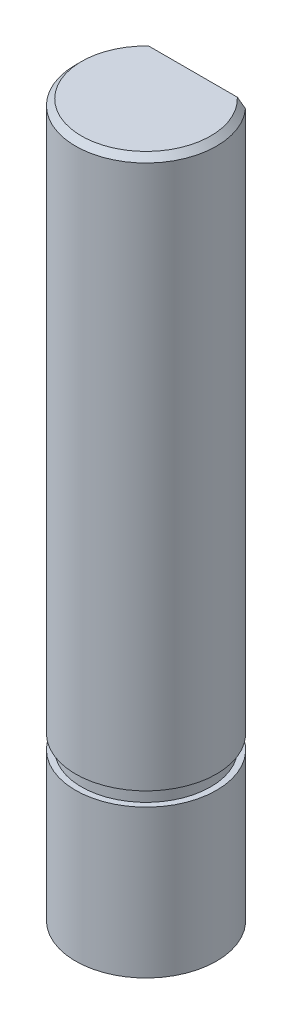
ISO-10303-21;
HEADER;
FILE_DESCRIPTION(('STEP AP214'),'2;1');
FILE_NAME('part.step','',(''),(''),'','','');
FILE_SCHEMA(('AUTOMOTIVE_DESIGN { 1 0 10303 214 1 1 1 1 }'));
ENDSEC;
DATA;
#1=APPLICATION_CONTEXT('core data for automotive mechanical design processes');
#2=APPLICATION_PROTOCOL_DEFINITION('international standard','automotive_design',2000,#1);
#3=PRODUCT_CONTEXT('',#1,'mechanical');
#4=PRODUCT('Part','Part','',(#3));
#5=PRODUCT_RELATED_PRODUCT_CATEGORY('part','',(#4));
#6=PRODUCT_DEFINITION_FORMATION('','',#4);
#7=PRODUCT_DEFINITION_CONTEXT('part definition',#1,'design');
#8=PRODUCT_DEFINITION('design','',#6,#7);
#9=PRODUCT_DEFINITION_SHAPE('','',#8);
#10=(LENGTH_UNIT() NAMED_UNIT(*) SI_UNIT(.MILLI.,.METRE.));
#11=(NAMED_UNIT(*) PLANE_ANGLE_UNIT() SI_UNIT($,.RADIAN.));
#12=(NAMED_UNIT(*) SI_UNIT($,.STERADIAN.) SOLID_ANGLE_UNIT());
#13=UNCERTAINTY_MEASURE_WITH_UNIT(LENGTH_MEASURE(1.E-05),#10,'distance_accuracy_value','');
#14=(GEOMETRIC_REPRESENTATION_CONTEXT(3) GLOBAL_UNCERTAINTY_ASSIGNED_CONTEXT((#13)) GLOBAL_UNIT_ASSIGNED_CONTEXT((#10,
#11,#12)) REPRESENTATION_CONTEXT('',''));
#15=CARTESIAN_POINT('',(0.,0.,0.));
#16=DIRECTION('',(0.,0.,1.));
#17=DIRECTION('',(1.,0.,0.));
#18=AXIS2_PLACEMENT_3D('',#15,#16,#17);
#19=CARTESIAN_POINT('',(0.,16.4,0.));
#20=DIRECTION('',(0.,1.,0.));
#21=DIRECTION('',(-1.,0.,0.));
#22=AXIS2_PLACEMENT_3D('',#19,#20,#21);
#23=CYLINDRICAL_SURFACE('',#22,3.);
#24=DIRECTION('',(0.,1.,0.));
#25=VECTOR('',#24,1.);
#26=CARTESIAN_POINT('',(2.23606797749979,16.4,-2.));
#27=LINE('',#26,#25);
#28=CARTESIAN_POINT('',(2.23606797749979,20.4,-2.));
#29=VERTEX_POINT('',#28);
#30=CARTESIAN_POINT('',(2.23606797749979,40.15,-2.));
#31=VERTEX_POINT('',#30);
#32=EDGE_CURVE('E125',#29,#31,#27,.T.);
#33=ORIENTED_EDGE('',*,*,#32,.T.);
#34=CARTESIAN_POINT('',(0.,40.15,0.));
#35=DIRECTION('',(0.,1.,0.));
#36=DIRECTION('',(-1.,0.,0.));
#37=AXIS2_PLACEMENT_3D('',#34,#35,#36);
#38=CIRCLE('',#37,3.);
#39=CARTESIAN_POINT('',(3.,40.15,0.));
#40=VERTEX_POINT('',#39);
#41=EDGE_CURVE('E30',#40,#31,#38,.T.);
#42=ORIENTED_EDGE('',*,*,#41,.F.);
#43=DIRECTION('',(0.,-1.,0.));
#44=VECTOR('',#43,1.);
#45=CARTESIAN_POINT('',(3.,16.4,0.));
#46=LINE('',#45,#44);
#47=CARTESIAN_POINT('',(3.,17.,0.));
#48=VERTEX_POINT('',#47);
#49=EDGE_CURVE('E11',#40,#48,#46,.T.);
#50=ORIENTED_EDGE('',*,*,#49,.T.);
#51=CARTESIAN_POINT('',(0.,17.,0.));
#52=DIRECTION('',(0.,1.,0.));
#53=DIRECTION('',(-1.,0.,0.));
#54=AXIS2_PLACEMENT_3D('',#51,#52,#53);
#55=CIRCLE('',#54,3.);
#56=EDGE_CURVE('E114',#48,#48,#55,.T.);
#57=ORIENTED_EDGE('',*,*,#56,.T.);
#58=ORIENTED_EDGE('',*,*,#49,.F.);
#59=CARTESIAN_POINT('',(0.,40.15,0.));
#60=DIRECTION('',(0.,1.,0.));
#61=DIRECTION('',(-1.,0.,0.));
#62=AXIS2_PLACEMENT_3D('',#59,#60,#61);
#63=CIRCLE('',#62,3.);
#64=CARTESIAN_POINT('',(-2.23606797749979,40.15,-2.));
#65=VERTEX_POINT('',#64);
#66=EDGE_CURVE('E151',#65,#40,#63,.T.);
#67=ORIENTED_EDGE('',*,*,#66,.F.);
#68=DIRECTION('',(0.,-1.,0.));
#69=VECTOR('',#68,1.);
#70=CARTESIAN_POINT('',(-2.23606797749979,16.4,-2.));
#71=LINE('',#70,#69);
#72=CARTESIAN_POINT('',(-2.23606797749979,20.4,-2.));
#73=VERTEX_POINT('',#72);
#74=EDGE_CURVE('E133',#65,#73,#71,.T.);
#75=ORIENTED_EDGE('',*,*,#74,.T.);
#76=CARTESIAN_POINT('',(0.,20.4,0.));
#77=DIRECTION('',(0.,-1.,0.));
#78=DIRECTION('',(-1.,0.,0.));
#79=AXIS2_PLACEMENT_3D('',#76,#77,#78);
#80=CIRCLE('',#79,3.);
#81=EDGE_CURVE('E159',#73,#29,#80,.T.);
#82=ORIENTED_EDGE('',*,*,#81,.T.);
#83=EDGE_LOOP('',(#33,#42,#50,#57,#58,#67,#75,#82));
#84=FACE_BOUND('',#83,.T.);
#85=ADVANCED_FACE('F19',(#84),#23,.T.);
#86=CARTESIAN_POINT('',(0.,40.275,0.));
#87=DIRECTION('',(0.,-1.,0.));
#88=DIRECTION('',(0.,0.,1.));
#89=AXIS2_PLACEMENT_3D('',#86,#87,#88);
#90=CONICAL_SURFACE('',#89,2.875,0.785398163397442);
#91=CARTESIAN_POINT('',(2.23606797749979,40.15,-2.));
#92=CARTESIAN_POINT('',(2.05418482862217,40.2855676949507,-2.));
#93=CARTESIAN_POINT('',(1.88745860881769,40.4,-2.));
#94=(BOUNDED_CURVE() B_SPLINE_CURVE(2,(#91,#92,#93),.UNSPECIFIED.,.F.,
.F.) B_SPLINE_CURVE_WITH_KNOTS((3,3),(0.,0.0429005754329433),
.UNSPECIFIED.) CURVE() GEOMETRIC_REPRESENTATION_ITEM() RATIONAL_B_SPLINE_CURVE((1.,
1.00184294215737,1.)) REPRESENTATION_ITEM(''));
#95=CARTESIAN_POINT('',(1.88745860881769,40.4,-2.));
#96=VERTEX_POINT('',#95);
#97=EDGE_CURVE('E120',#31,#96,#94,.T.);
#98=ORIENTED_EDGE('',*,*,#97,.T.);
#99=CARTESIAN_POINT('',(0.,40.4,0.));
#100=DIRECTION('',(0.,-1.,0.));
#101=DIRECTION('',(-1.,0.,0.));
#102=AXIS2_PLACEMENT_3D('',#99,#100,#101);
#103=CIRCLE('',#102,2.75);
#104=CARTESIAN_POINT('',(-1.88745860881769,40.4,-2.));
#105=VERTEX_POINT('',#104);
#106=EDGE_CURVE('E61',#96,#105,#103,.T.);
#107=ORIENTED_EDGE('',*,*,#106,.T.);
#108=CARTESIAN_POINT('',(-1.88745860881769,40.4,-2.));
#109=CARTESIAN_POINT('',(-2.05418482862217,40.2855676949507,-2.));
#110=CARTESIAN_POINT('',(-2.23606797749979,40.15,-2.));
#111=(BOUNDED_CURVE() B_SPLINE_CURVE(2,(#108,#109,#110),.UNSPECIFIED.,.F.,
.F.) B_SPLINE_CURVE_WITH_KNOTS((3,3),(0.,0.0429005754329433),
.UNSPECIFIED.) CURVE() GEOMETRIC_REPRESENTATION_ITEM() RATIONAL_B_SPLINE_CURVE((1.,
1.00184294215737,1.)) REPRESENTATION_ITEM(''));
#112=EDGE_CURVE('E138',#105,#65,#111,.T.);
#113=ORIENTED_EDGE('',*,*,#112,.T.);
#114=ORIENTED_EDGE('',*,*,#66,.T.);
#115=ORIENTED_EDGE('',*,*,#41,.T.);
#116=EDGE_LOOP('',(#98,#107,#113,#114,#115));
#117=FACE_BOUND('',#116,.T.);
#118=ADVANCED_FACE('F244',(#117),#90,.T.);
#119=CARTESIAN_POINT('',(0.,40.4,0.));
#120=DIRECTION('',(0.,1.,0.));
#121=DIRECTION('',(1.,0.,0.));
#122=AXIS2_PLACEMENT_3D('',#119,#120,#121);
#123=PLANE('',#122);
#124=DIRECTION('',(-1.,0.,0.));
#125=VECTOR('',#124,1.);
#126=CARTESIAN_POINT('',(1.11803398874989,40.4,-2.));
#127=LINE('',#126,#125);
#128=EDGE_CURVE('E23',#96,#105,#127,.T.);
#129=ORIENTED_EDGE('',*,*,#128,.T.);
#130=ORIENTED_EDGE('',*,*,#106,.F.);
#131=EDGE_LOOP('',(#129,#130));
#132=FACE_BOUND('',#131,.T.);
#133=ADVANCED_FACE('F248',(#132),#123,.T.);
#134=CARTESIAN_POINT('',(0.,20.4,-2.5));
#135=DIRECTION('',(0.,1.,0.));
#136=DIRECTION('',(1.,0.,0.));
#137=AXIS2_PLACEMENT_3D('',#134,#135,#136);
#138=PLANE('',#137);
#139=ORIENTED_EDGE('',*,*,#81,.F.);
#140=DIRECTION('',(-1.,0.,0.));
#141=VECTOR('',#140,1.);
#142=CARTESIAN_POINT('',(1.11803398874989,20.4,-2.));
#143=LINE('',#142,#141);
#144=EDGE_CURVE('E126',#29,#73,#143,.T.);
#145=ORIENTED_EDGE('',*,*,#144,.F.);
#146=EDGE_LOOP('',(#139,#145));
#147=FACE_BOUND('',#146,.T.);
#148=ADVANCED_FACE('F253',(#147),#138,.T.);
#149=CARTESIAN_POINT('',(2.23606797749979,40.4,-2.));
#150=DIRECTION('',(0.,0.,1.));
#151=DIRECTION('',(1.,0.,0.));
#152=AXIS2_PLACEMENT_3D('',#149,#150,#151);
#153=PLANE('',#152);
#154=ORIENTED_EDGE('',*,*,#97,.F.);
#155=ORIENTED_EDGE('',*,*,#32,.F.);
#156=ORIENTED_EDGE('',*,*,#144,.T.);
#157=ORIENTED_EDGE('',*,*,#74,.F.);
#158=ORIENTED_EDGE('',*,*,#112,.F.);
#159=ORIENTED_EDGE('',*,*,#128,.F.);
#160=EDGE_LOOP('',(#154,#155,#156,#157,#158,#159));
#161=FACE_BOUND('',#160,.T.);
#162=ADVANCED_FACE('F251',(#161),#153,.F.);
#163=CARTESIAN_POINT('',(0.,10.1,0.));
#164=DIRECTION('',(0.,1.,0.));
#165=DIRECTION('',(1.,0.,0.));
#166=AXIS2_PLACEMENT_3D('',#163,#164,#165);
#167=PLANE('',#166);
#168=CARTESIAN_POINT('',(0.,10.1,0.));
#169=DIRECTION('',(0.,-1.,0.));
#170=DIRECTION('',(-1.,0.,0.));
#171=AXIS2_PLACEMENT_3D('',#168,#169,#170);
#172=CIRCLE('',#171,3.);
#173=CARTESIAN_POINT('',(3.,10.1,0.));
#174=VERTEX_POINT('',#173);
#175=EDGE_CURVE('E83',#174,#174,#172,.T.);
#176=ORIENTED_EDGE('',*,*,#175,.T.);
#177=EDGE_LOOP('',(#176));
#178=FACE_BOUND('',#177,.T.);
#179=ADVANCED_FACE('F21',(#178),#167,.F.);
#180=CARTESIAN_POINT('',(0.,16.4,0.));
#181=DIRECTION('',(0.,1.,0.));
#182=DIRECTION('',(-1.,0.,0.));
#183=AXIS2_PLACEMENT_3D('',#180,#181,#182);
#184=CYLINDRICAL_SURFACE('',#183,3.);
#185=CARTESIAN_POINT('',(0.,16.4,0.));
#186=DIRECTION('',(0.,-1.,0.));
#187=DIRECTION('',(-1.,0.,0.));
#188=AXIS2_PLACEMENT_3D('',#185,#186,#187);
#189=CIRCLE('',#188,3.);
#190=CARTESIAN_POINT('',(3.,16.4,0.));
#191=VERTEX_POINT('',#190);
#192=EDGE_CURVE('E118',#191,#191,#189,.T.);
#193=ORIENTED_EDGE('',*,*,#192,.T.);
#194=DIRECTION('',(0.,-1.,0.));
#195=VECTOR('',#194,1.);
#196=CARTESIAN_POINT('',(3.,16.4,0.));
#197=LINE('',#196,#195);
#198=EDGE_CURVE('E144',#191,#174,#197,.T.);
#199=ORIENTED_EDGE('',*,*,#198,.T.);
#200=ORIENTED_EDGE('',*,*,#175,.F.);
#201=ORIENTED_EDGE('',*,*,#198,.F.);
#202=EDGE_LOOP('',(#193,#199,#200,#201));
#203=FACE_BOUND('',#202,.T.);
#204=ADVANCED_FACE('F226',(#203),#184,.T.);
#205=CARTESIAN_POINT('',(0.,16.4,0.));
#206=DIRECTION('',(0.,1.,0.));
#207=DIRECTION('',(1.,0.,0.));
#208=AXIS2_PLACEMENT_3D('',#205,#206,#207);
#209=PLANE('',#208);
#210=CARTESIAN_POINT('',(0.,16.4,0.));
#211=DIRECTION('',(0.,1.,0.));
#212=DIRECTION('',(-1.,0.,0.));
#213=AXIS2_PLACEMENT_3D('',#210,#211,#212);
#214=CIRCLE('',#213,2.75);
#215=CARTESIAN_POINT('',(2.75,16.4,0.));
#216=VERTEX_POINT('',#215);
#217=EDGE_CURVE('E106',#216,#216,#214,.T.);
#218=ORIENTED_EDGE('',*,*,#217,.F.);
#219=EDGE_LOOP('',(#218));
#220=FACE_BOUND('',#219,.T.);
#221=ORIENTED_EDGE('',*,*,#192,.F.);
#222=EDGE_LOOP('',(#221));
#223=FACE_BOUND('',#222,.T.);
#224=ADVANCED_FACE('F228',(#220,#223),#209,.T.);
#225=CARTESIAN_POINT('',(0.,17.,0.));
#226=DIRECTION('',(0.,1.,0.));
#227=DIRECTION('',(1.,0.,0.));
#228=AXIS2_PLACEMENT_3D('',#225,#226,#227);
#229=PLANE('',#228);
#230=CARTESIAN_POINT('',(0.,17.,0.));
#231=DIRECTION('',(0.,-1.,0.));
#232=DIRECTION('',(-1.,0.,0.));
#233=AXIS2_PLACEMENT_3D('',#230,#231,#232);
#234=CIRCLE('',#233,2.75);
#235=CARTESIAN_POINT('',(2.75,17.,0.));
#236=VERTEX_POINT('',#235);
#237=EDGE_CURVE('E98',#236,#236,#234,.T.);
#238=ORIENTED_EDGE('',*,*,#237,.F.);
#239=EDGE_LOOP('',(#238));
#240=FACE_BOUND('',#239,.T.);
#241=ORIENTED_EDGE('',*,*,#56,.F.);
#242=EDGE_LOOP('',(#241));
#243=FACE_BOUND('',#242,.T.);
#244=ADVANCED_FACE('F230',(#240,#243),#229,.F.);
#245=CARTESIAN_POINT('',(0.,16.4,0.));
#246=DIRECTION('',(0.,1.,0.));
#247=DIRECTION('',(-1.,0.,0.));
#248=AXIS2_PLACEMENT_3D('',#245,#246,#247);
#249=CYLINDRICAL_SURFACE('',#248,2.75);
#250=ORIENTED_EDGE('',*,*,#217,.T.);
#251=DIRECTION('',(0.,1.,0.));
#252=VECTOR('',#251,1.);
#253=CARTESIAN_POINT('',(2.75,16.4,0.));
#254=LINE('',#253,#252);
#255=EDGE_CURVE('E103',#216,#236,#254,.T.);
#256=ORIENTED_EDGE('',*,*,#255,.T.);
#257=ORIENTED_EDGE('',*,*,#237,.T.);
#258=ORIENTED_EDGE('',*,*,#255,.F.);
#259=EDGE_LOOP('',(#250,#256,#257,#258));
#260=FACE_BOUND('',#259,.T.);
#261=ADVANCED_FACE('F104',(#260),#249,.T.);
#262=CLOSED_SHELL('',(#85,#118,#133,#148,#162,#179,#204,#224,#244,#261));
#263=MANIFOLD_SOLID_BREP('B1',#262);
#264=ADVANCED_BREP_SHAPE_REPRESENTATION('',(#18,#263),#14);
#265=SHAPE_DEFINITION_REPRESENTATION(#9,#264);
ENDSEC;
END-ISO-10303-21;
